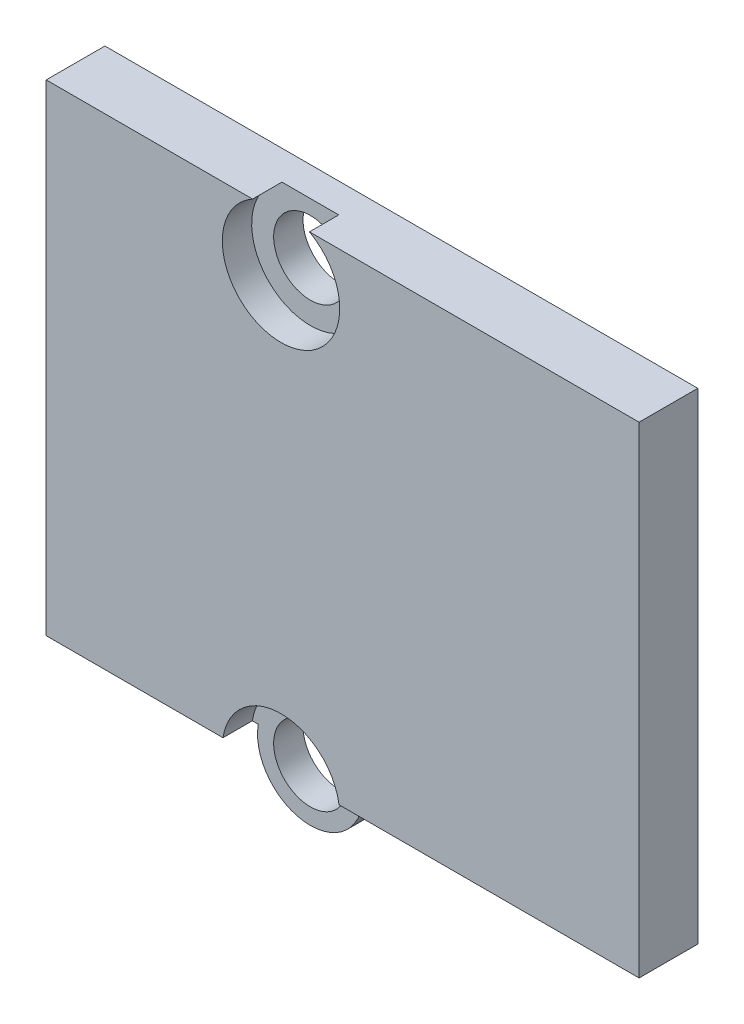
ISO-10303-21;
HEADER;
FILE_DESCRIPTION(('STEP AP214'),'2;1');
FILE_NAME('part.step','',(''),(''),'','','');
FILE_SCHEMA(('AUTOMOTIVE_DESIGN { 1 0 10303 214 1 1 1 1 }'));
ENDSEC;
DATA;
#1=APPLICATION_CONTEXT('core data for automotive mechanical design processes');
#2=APPLICATION_PROTOCOL_DEFINITION('international standard','automotive_design',2000,#1);
#3=PRODUCT_CONTEXT('',#1,'mechanical');
#4=PRODUCT('Part','Part','',(#3));
#5=PRODUCT_RELATED_PRODUCT_CATEGORY('part','',(#4));
#6=PRODUCT_DEFINITION_FORMATION('','',#4);
#7=PRODUCT_DEFINITION_CONTEXT('part definition',#1,'design');
#8=PRODUCT_DEFINITION('design','',#6,#7);
#9=PRODUCT_DEFINITION_SHAPE('','',#8);
#10=(LENGTH_UNIT() NAMED_UNIT(*) SI_UNIT(.MILLI.,.METRE.));
#11=(NAMED_UNIT(*) PLANE_ANGLE_UNIT() SI_UNIT($,.RADIAN.));
#12=(NAMED_UNIT(*) SI_UNIT($,.STERADIAN.) SOLID_ANGLE_UNIT());
#13=UNCERTAINTY_MEASURE_WITH_UNIT(LENGTH_MEASURE(1.E-05),#10,'distance_accuracy_value','');
#14=(GEOMETRIC_REPRESENTATION_CONTEXT(3) GLOBAL_UNCERTAINTY_ASSIGNED_CONTEXT((#13)) GLOBAL_UNIT_ASSIGNED_CONTEXT((#10,
#11,#12)) REPRESENTATION_CONTEXT('',''));
#15=CARTESIAN_POINT('',(0.,0.,0.));
#16=DIRECTION('',(0.,0.,1.));
#17=DIRECTION('',(1.,0.,0.));
#18=AXIS2_PLACEMENT_3D('',#15,#16,#17);
#19=CARTESIAN_POINT('',(0.,0.,2.));
#20=DIRECTION('',(0.,0.,-1.));
#21=DIRECTION('',(-1.,0.,0.));
#22=AXIS2_PLACEMENT_3D('',#19,#20,#21);
#23=CYLINDRICAL_SURFACE('',#22,1.8);
#24=CARTESIAN_POINT('',(0.,0.,1.));
#25=DIRECTION('',(0.,0.,1.));
#26=DIRECTION('',(1.,0.,0.));
#27=AXIS2_PLACEMENT_3D('',#24,#25,#26);
#28=CIRCLE('',#27,1.8);
#29=CARTESIAN_POINT('',(-1.77482393492989,0.299999999999998,1.));
#30=VERTEX_POINT('',#29);
#31=CARTESIAN_POINT('',(1.77482393492989,0.299999999999998,1.));
#32=VERTEX_POINT('',#31);
#33=EDGE_CURVE('E55',#30,#32,#28,.T.);
#34=ORIENTED_EDGE('',*,*,#33,.F.);
#35=DIRECTION('',(0.,0.,-1.));
#36=VECTOR('',#35,1.);
#37=CARTESIAN_POINT('',(-1.77482393492989,0.299999999999998,2.));
#38=LINE('',#37,#36);
#39=CARTESIAN_POINT('',(-1.77482393492989,0.299999999999998,0.));
#40=VERTEX_POINT('',#39);
#41=EDGE_CURVE('E161',#30,#40,#38,.T.);
#42=ORIENTED_EDGE('',*,*,#41,.T.);
#43=CARTESIAN_POINT('',(0.,0.,0.));
#44=DIRECTION('',(0.,0.,1.));
#45=DIRECTION('',(1.,0.,0.));
#46=AXIS2_PLACEMENT_3D('',#43,#44,#45);
#47=CIRCLE('',#46,1.8);
#48=CARTESIAN_POINT('',(1.77482393492989,0.299999999999998,0.));
#49=VERTEX_POINT('',#48);
#50=EDGE_CURVE('E152',#40,#49,#47,.T.);
#51=ORIENTED_EDGE('',*,*,#50,.T.);
#52=DIRECTION('',(0.,0.,-1.));
#53=VECTOR('',#52,1.);
#54=CARTESIAN_POINT('',(1.77482393492989,0.299999999999998,2.));
#55=LINE('',#54,#53);
#56=EDGE_CURVE('E159',#32,#49,#55,.T.);
#57=ORIENTED_EDGE('',*,*,#56,.F.);
#58=EDGE_LOOP('',(#34,#42,#51,#57));
#59=FACE_BOUND('',#58,.T.);
#60=ADVANCED_FACE('F33',(#59),#23,.T.);
#61=CARTESIAN_POINT('',(0.,0.,2.));
#62=DIRECTION('',(0.,0.,-1.));
#63=DIRECTION('',(-1.,0.,0.));
#64=AXIS2_PLACEMENT_3D('',#61,#62,#63);
#65=CYLINDRICAL_SURFACE('',#64,1.25);
#66=CARTESIAN_POINT('',(0.,0.,0.));
#67=DIRECTION('',(0.,0.,1.));
#68=DIRECTION('',(1.,0.,0.));
#69=AXIS2_PLACEMENT_3D('',#66,#67,#68);
#70=CIRCLE('',#69,1.25);
#71=CARTESIAN_POINT('',(1.25,0.,0.));
#72=VERTEX_POINT('',#71);
#73=EDGE_CURVE('E145',#72,#72,#70,.T.);
#74=ORIENTED_EDGE('',*,*,#73,.F.);
#75=EDGE_LOOP('',(#74));
#76=FACE_BOUND('',#75,.T.);
#77=CARTESIAN_POINT('',(0.,0.,1.));
#78=DIRECTION('',(0.,0.,1.));
#79=DIRECTION('',(1.,0.,0.));
#80=AXIS2_PLACEMENT_3D('',#77,#78,#79);
#81=CIRCLE('',#80,1.25);
#82=CARTESIAN_POINT('',(1.25,0.,1.));
#83=VERTEX_POINT('',#82);
#84=EDGE_CURVE('E175',#83,#83,#81,.T.);
#85=ORIENTED_EDGE('',*,*,#84,.T.);
#86=EDGE_LOOP('',(#85));
#87=FACE_BOUND('',#86,.T.);
#88=ADVANCED_FACE('F211',(#76,#87),#65,.F.);
#89=CARTESIAN_POINT('',(0.,14.95,2.));
#90=DIRECTION('',(0.,0.,-1.));
#91=DIRECTION('',(-1.,0.,0.));
#92=AXIS2_PLACEMENT_3D('',#89,#90,#91);
#93=CYLINDRICAL_SURFACE('',#92,1.25);
#94=CARTESIAN_POINT('',(0.,14.95,0.));
#95=DIRECTION('',(0.,0.,1.));
#96=DIRECTION('',(1.,0.,0.));
#97=AXIS2_PLACEMENT_3D('',#94,#95,#96);
#98=CIRCLE('',#97,1.25);
#99=CARTESIAN_POINT('',(1.25,14.95,0.));
#100=VERTEX_POINT('',#99);
#101=EDGE_CURVE('E199',#100,#100,#98,.T.);
#102=ORIENTED_EDGE('',*,*,#101,.F.);
#103=EDGE_LOOP('',(#102));
#104=FACE_BOUND('',#103,.T.);
#105=CARTESIAN_POINT('',(0.,14.95,1.));
#106=DIRECTION('',(0.,0.,1.));
#107=DIRECTION('',(1.,0.,0.));
#108=AXIS2_PLACEMENT_3D('',#105,#106,#107);
#109=CIRCLE('',#108,1.25);
#110=CARTESIAN_POINT('',(1.25,14.95,1.));
#111=VERTEX_POINT('',#110);
#112=EDGE_CURVE('E172',#111,#111,#109,.T.);
#113=ORIENTED_EDGE('',*,*,#112,.T.);
#114=EDGE_LOOP('',(#113));
#115=FACE_BOUND('',#114,.T.);
#116=ADVANCED_FACE('F214',(#104,#115),#93,.F.);
#117=CARTESIAN_POINT('',(0.,0.,2.));
#118=DIRECTION('',(0.,0.,1.));
#119=DIRECTION('',(1.,0.,0.));
#120=AXIS2_PLACEMENT_3D('',#117,#118,#119);
#121=PLANE('',#120);
#122=CARTESIAN_POINT('',(0.,14.95,2.));
#123=DIRECTION('',(0.,0.,1.));
#124=DIRECTION('',(1.,0.,0.));
#125=AXIS2_PLACEMENT_3D('',#122,#123,#124);
#126=CIRCLE('',#125,2.);
#127=CARTESIAN_POINT('',(-0.968245836551859,16.7,2.));
#128=VERTEX_POINT('',#127);
#129=CARTESIAN_POINT('',(0.968245836551858,16.7,2.));
#130=VERTEX_POINT('',#129);
#131=EDGE_CURVE('E109',#128,#130,#126,.T.);
#132=ORIENTED_EDGE('',*,*,#131,.F.);
#133=DIRECTION('',(-1.,0.,0.));
#134=VECTOR('',#133,1.);
#135=CARTESIAN_POINT('',(12.2,16.7,2.));
#136=LINE('',#135,#134);
#137=CARTESIAN_POINT('',(-8.,16.7,2.));
#138=VERTEX_POINT('',#137);
#139=EDGE_CURVE('E129',#128,#138,#136,.T.);
#140=ORIENTED_EDGE('',*,*,#139,.T.);
#141=DIRECTION('',(0.,-1.,0.));
#142=VECTOR('',#141,1.);
#143=CARTESIAN_POINT('',(-8.,16.7,2.));
#144=LINE('',#143,#142);
#145=CARTESIAN_POINT('',(-8.,0.299999999999998,2.));
#146=VERTEX_POINT('',#145);
#147=EDGE_CURVE('E128',#138,#146,#144,.T.);
#148=ORIENTED_EDGE('',*,*,#147,.T.);
#149=DIRECTION('',(1.,0.,0.));
#150=VECTOR('',#149,1.);
#151=CARTESIAN_POINT('',(-8.,0.299999999999998,2.));
#152=LINE('',#151,#150);
#153=CARTESIAN_POINT('',(-1.97737199332852,0.299999999999998,2.));
#154=VERTEX_POINT('',#153);
#155=EDGE_CURVE('E131',#146,#154,#152,.T.);
#156=ORIENTED_EDGE('',*,*,#155,.T.);
#157=CARTESIAN_POINT('',(0.,0.,2.));
#158=DIRECTION('',(0.,0.,1.));
#159=DIRECTION('',(1.,0.,0.));
#160=AXIS2_PLACEMENT_3D('',#157,#158,#159);
#161=CIRCLE('',#160,2.);
#162=CARTESIAN_POINT('',(1.97737199332852,0.299999999999998,2.));
#163=VERTEX_POINT('',#162);
#164=EDGE_CURVE('E349',#163,#154,#161,.T.);
#165=ORIENTED_EDGE('',*,*,#164,.F.);
#166=DIRECTION('',(1.,0.,0.));
#167=VECTOR('',#166,1.);
#168=CARTESIAN_POINT('',(1.77482393492989,0.299999999999998,2.));
#169=LINE('',#168,#167);
#170=CARTESIAN_POINT('',(12.2,0.299999999999998,2.));
#171=VERTEX_POINT('',#170);
#172=EDGE_CURVE('E138',#163,#171,#169,.T.);
#173=ORIENTED_EDGE('',*,*,#172,.T.);
#174=DIRECTION('',(0.,1.,0.));
#175=VECTOR('',#174,1.);
#176=CARTESIAN_POINT('',(12.2,0.299999999999998,2.));
#177=LINE('',#176,#175);
#178=CARTESIAN_POINT('',(12.2,16.7,2.));
#179=VERTEX_POINT('',#178);
#180=EDGE_CURVE('E126',#171,#179,#177,.T.);
#181=ORIENTED_EDGE('',*,*,#180,.T.);
#182=EDGE_CURVE('E121',#179,#130,#136,.T.);
#183=ORIENTED_EDGE('',*,*,#182,.T.);
#184=EDGE_LOOP('',(#132,#140,#148,#156,#165,#173,#181,#183));
#185=FACE_BOUND('',#184,.T.);
#186=ADVANCED_FACE('F124',(#185),#121,.T.);
#187=CARTESIAN_POINT('',(0.,0.,0.));
#188=DIRECTION('',(0.,0.,1.));
#189=DIRECTION('',(1.,0.,0.));
#190=AXIS2_PLACEMENT_3D('',#187,#188,#189);
#191=PLANE('',#190);
#192=DIRECTION('',(0.,1.,0.));
#193=VECTOR('',#192,1.);
#194=CARTESIAN_POINT('',(12.2,0.299999999999998,0.));
#195=LINE('',#194,#193);
#196=CARTESIAN_POINT('',(12.2,0.299999999999998,0.));
#197=VERTEX_POINT('',#196);
#198=CARTESIAN_POINT('',(12.2,16.7,0.));
#199=VERTEX_POINT('',#198);
#200=EDGE_CURVE('E141',#197,#199,#195,.T.);
#201=ORIENTED_EDGE('',*,*,#200,.F.);
#202=DIRECTION('',(1.,0.,0.));
#203=VECTOR('',#202,1.);
#204=CARTESIAN_POINT('',(1.77482393492989,0.299999999999998,0.));
#205=LINE('',#204,#203);
#206=EDGE_CURVE('E155',#49,#197,#205,.T.);
#207=ORIENTED_EDGE('',*,*,#206,.F.);
#208=ORIENTED_EDGE('',*,*,#50,.F.);
#209=DIRECTION('',(1.,0.,0.));
#210=VECTOR('',#209,1.);
#211=CARTESIAN_POINT('',(-8.,0.299999999999998,0.));
#212=LINE('',#211,#210);
#213=CARTESIAN_POINT('',(-8.,0.299999999999998,0.));
#214=VERTEX_POINT('',#213);
#215=EDGE_CURVE('E149',#214,#40,#212,.T.);
#216=ORIENTED_EDGE('',*,*,#215,.F.);
#217=DIRECTION('',(0.,-1.,0.));
#218=VECTOR('',#217,1.);
#219=CARTESIAN_POINT('',(-8.,16.7,0.));
#220=LINE('',#219,#218);
#221=CARTESIAN_POINT('',(-8.,16.7,0.));
#222=VERTEX_POINT('',#221);
#223=EDGE_CURVE('E147',#222,#214,#220,.T.);
#224=ORIENTED_EDGE('',*,*,#223,.F.);
#225=DIRECTION('',(-1.,0.,0.));
#226=VECTOR('',#225,1.);
#227=CARTESIAN_POINT('',(12.2,16.7,0.));
#228=LINE('',#227,#226);
#229=EDGE_CURVE('E144',#199,#222,#228,.T.);
#230=ORIENTED_EDGE('',*,*,#229,.F.);
#231=EDGE_LOOP('',(#201,#207,#208,#216,#224,#230));
#232=FACE_BOUND('',#231,.T.);
#233=ORIENTED_EDGE('',*,*,#73,.T.);
#234=EDGE_LOOP('',(#233));
#235=FACE_BOUND('',#234,.T.);
#236=ORIENTED_EDGE('',*,*,#101,.T.);
#237=EDGE_LOOP('',(#236));
#238=FACE_BOUND('',#237,.T.);
#239=ADVANCED_FACE('F208',(#232,#235,#238),#191,.F.);
#240=CARTESIAN_POINT('',(12.2,0.299999999999998,2.));
#241=DIRECTION('',(-1.,0.,0.));
#242=DIRECTION('',(0.,0.,1.));
#243=AXIS2_PLACEMENT_3D('',#240,#241,#242);
#244=PLANE('',#243);
#245=ORIENTED_EDGE('',*,*,#200,.T.);
#246=DIRECTION('',(0.,0.,-1.));
#247=VECTOR('',#246,1.);
#248=CARTESIAN_POINT('',(12.2,16.7,2.));
#249=LINE('',#248,#247);
#250=EDGE_CURVE('E169',#179,#199,#249,.T.);
#251=ORIENTED_EDGE('',*,*,#250,.F.);
#252=ORIENTED_EDGE('',*,*,#180,.F.);
#253=DIRECTION('',(0.,0.,-1.));
#254=VECTOR('',#253,1.);
#255=CARTESIAN_POINT('',(12.2,0.299999999999998,2.));
#256=LINE('',#255,#254);
#257=EDGE_CURVE('E140',#171,#197,#256,.T.);
#258=ORIENTED_EDGE('',*,*,#257,.T.);
#259=EDGE_LOOP('',(#245,#251,#252,#258));
#260=FACE_BOUND('',#259,.T.);
#261=ADVANCED_FACE('F35',(#260),#244,.F.);
#262=CARTESIAN_POINT('',(12.2,16.7,2.));
#263=DIRECTION('',(0.,-1.,0.));
#264=DIRECTION('',(1.,0.,0.));
#265=AXIS2_PLACEMENT_3D('',#262,#263,#264);
#266=PLANE('',#265);
#267=DIRECTION('',(-1.,0.,0.));
#268=VECTOR('',#267,1.);
#269=CARTESIAN_POINT('',(12.2,16.7,1.));
#270=LINE('',#269,#268);
#271=CARTESIAN_POINT('',(0.968245836551858,16.7,1.));
#272=VERTEX_POINT('',#271);
#273=CARTESIAN_POINT('',(-0.968245836551859,16.7,1.));
#274=VERTEX_POINT('',#273);
#275=EDGE_CURVE('E123',#272,#274,#270,.T.);
#276=ORIENTED_EDGE('',*,*,#275,.F.);
#277=DIRECTION('',(0.,0.,1.));
#278=VECTOR('',#277,1.);
#279=CARTESIAN_POINT('',(0.96824583655186,16.7,1.));
#280=LINE('',#279,#278);
#281=EDGE_CURVE('E11',#272,#130,#280,.T.);
#282=ORIENTED_EDGE('',*,*,#281,.T.);
#283=ORIENTED_EDGE('',*,*,#182,.F.);
#284=ORIENTED_EDGE('',*,*,#250,.T.);
#285=ORIENTED_EDGE('',*,*,#229,.T.);
#286=DIRECTION('',(0.,0.,-1.));
#287=VECTOR('',#286,1.);
#288=CARTESIAN_POINT('',(-8.,16.7,2.));
#289=LINE('',#288,#287);
#290=EDGE_CURVE('E166',#138,#222,#289,.T.);
#291=ORIENTED_EDGE('',*,*,#290,.F.);
#292=ORIENTED_EDGE('',*,*,#139,.F.);
#293=DIRECTION('',(0.,0.,1.));
#294=VECTOR('',#293,1.);
#295=CARTESIAN_POINT('',(-0.968245836551861,16.7,1.));
#296=LINE('',#295,#294);
#297=EDGE_CURVE('E41',#128,#274,#296,.F.);
#298=ORIENTED_EDGE('',*,*,#297,.T.);
#299=EDGE_LOOP('',(#276,#282,#283,#284,#285,#291,#292,#298));
#300=FACE_BOUND('',#299,.T.);
#301=ADVANCED_FACE('F119',(#300),#266,.F.);
#302=CARTESIAN_POINT('',(-8.,16.7,2.));
#303=DIRECTION('',(1.,0.,0.));
#304=DIRECTION('',(0.,0.,-1.));
#305=AXIS2_PLACEMENT_3D('',#302,#303,#304);
#306=PLANE('',#305);
#307=ORIENTED_EDGE('',*,*,#223,.T.);
#308=DIRECTION('',(0.,0.,-1.));
#309=VECTOR('',#308,1.);
#310=CARTESIAN_POINT('',(-8.,0.299999999999998,2.));
#311=LINE('',#310,#309);
#312=EDGE_CURVE('E163',#146,#214,#311,.T.);
#313=ORIENTED_EDGE('',*,*,#312,.F.);
#314=ORIENTED_EDGE('',*,*,#147,.F.);
#315=ORIENTED_EDGE('',*,*,#290,.T.);
#316=EDGE_LOOP('',(#307,#313,#314,#315));
#317=FACE_BOUND('',#316,.T.);
#318=ADVANCED_FACE('F186',(#317),#306,.F.);
#319=CARTESIAN_POINT('',(-8.,0.299999999999998,2.));
#320=DIRECTION('',(0.,1.,0.));
#321=DIRECTION('',(0.,0.,1.));
#322=AXIS2_PLACEMENT_3D('',#319,#320,#321);
#323=PLANE('',#322);
#324=DIRECTION('',(1.,0.,0.));
#325=VECTOR('',#324,1.);
#326=CARTESIAN_POINT('',(-8.,0.299999999999998,1.));
#327=LINE('',#326,#325);
#328=CARTESIAN_POINT('',(-1.97737199332852,0.299999999999998,1.));
#329=VERTEX_POINT('',#328);
#330=EDGE_CURVE('E195',#329,#30,#327,.T.);
#331=ORIENTED_EDGE('',*,*,#330,.F.);
#332=DIRECTION('',(0.,0.,1.));
#333=VECTOR('',#332,1.);
#334=CARTESIAN_POINT('',(-1.97737199332852,0.299999999999998,1.));
#335=LINE('',#334,#333);
#336=EDGE_CURVE('E193',#329,#154,#335,.T.);
#337=ORIENTED_EDGE('',*,*,#336,.T.);
#338=ORIENTED_EDGE('',*,*,#155,.F.);
#339=ORIENTED_EDGE('',*,*,#312,.T.);
#340=ORIENTED_EDGE('',*,*,#215,.T.);
#341=ORIENTED_EDGE('',*,*,#41,.F.);
#342=EDGE_LOOP('',(#331,#337,#338,#339,#340,#341));
#343=FACE_BOUND('',#342,.T.);
#344=ADVANCED_FACE('F192',(#343),#323,.F.);
#345=CARTESIAN_POINT('',(1.77482393492989,0.299999999999998,2.));
#346=DIRECTION('',(0.,1.,0.));
#347=DIRECTION('',(0.,0.,1.));
#348=AXIS2_PLACEMENT_3D('',#345,#346,#347);
#349=PLANE('',#348);
#350=ORIENTED_EDGE('',*,*,#172,.F.);
#351=DIRECTION('',(0.,0.,1.));
#352=VECTOR('',#351,1.);
#353=CARTESIAN_POINT('',(1.97737199332852,0.299999999999998,1.));
#354=LINE('',#353,#352);
#355=CARTESIAN_POINT('',(1.97737199332852,0.299999999999998,1.));
#356=VERTEX_POINT('',#355);
#357=EDGE_CURVE('E171',#163,#356,#354,.F.);
#358=ORIENTED_EDGE('',*,*,#357,.T.);
#359=DIRECTION('',(1.,0.,0.));
#360=VECTOR('',#359,1.);
#361=CARTESIAN_POINT('',(1.77482393492989,0.299999999999998,1.));
#362=LINE('',#361,#360);
#363=EDGE_CURVE('E178',#32,#356,#362,.T.);
#364=ORIENTED_EDGE('',*,*,#363,.F.);
#365=ORIENTED_EDGE('',*,*,#56,.T.);
#366=ORIENTED_EDGE('',*,*,#206,.T.);
#367=ORIENTED_EDGE('',*,*,#257,.F.);
#368=EDGE_LOOP('',(#350,#358,#364,#365,#366,#367));
#369=FACE_BOUND('',#368,.T.);
#370=ADVANCED_FACE('F231',(#369),#349,.F.);
#371=CARTESIAN_POINT('',(0.,14.95,1.));
#372=DIRECTION('',(0.,0.,1.));
#373=DIRECTION('',(1.,0.,0.));
#374=AXIS2_PLACEMENT_3D('',#371,#372,#373);
#375=CYLINDRICAL_SURFACE('',#374,2.);
#376=CARTESIAN_POINT('',(0.,14.95,1.));
#377=DIRECTION('',(0.,0.,1.));
#378=DIRECTION('',(1.,0.,0.));
#379=AXIS2_PLACEMENT_3D('',#376,#377,#378);
#380=CIRCLE('',#379,2.);
#381=EDGE_CURVE('E47',#274,#272,#380,.T.);
#382=ORIENTED_EDGE('',*,*,#381,.F.);
#383=ORIENTED_EDGE('',*,*,#297,.F.);
#384=ORIENTED_EDGE('',*,*,#131,.T.);
#385=ORIENTED_EDGE('',*,*,#281,.F.);
#386=EDGE_LOOP('',(#382,#383,#384,#385));
#387=FACE_BOUND('',#386,.T.);
#388=ADVANCED_FACE('F110',(#387),#375,.F.);
#389=CARTESIAN_POINT('',(0.,14.95,1.));
#390=DIRECTION('',(0.,0.,1.));
#391=DIRECTION('',(1.,0.,0.));
#392=AXIS2_PLACEMENT_3D('',#389,#390,#391);
#393=PLANE('',#392);
#394=ORIENTED_EDGE('',*,*,#112,.F.);
#395=EDGE_LOOP('',(#394));
#396=FACE_BOUND('',#395,.T.);
#397=ORIENTED_EDGE('',*,*,#275,.T.);
#398=ORIENTED_EDGE('',*,*,#381,.T.);
#399=EDGE_LOOP('',(#397,#398));
#400=FACE_BOUND('',#399,.T.);
#401=ADVANCED_FACE('F267',(#396,#400),#393,.T.);
#402=CARTESIAN_POINT('',(0.,0.,1.));
#403=DIRECTION('',(0.,0.,1.));
#404=DIRECTION('',(1.,0.,0.));
#405=AXIS2_PLACEMENT_3D('',#402,#403,#404);
#406=CYLINDRICAL_SURFACE('',#405,2.);
#407=CARTESIAN_POINT('',(0.,0.,1.));
#408=DIRECTION('',(0.,0.,1.));
#409=DIRECTION('',(1.,0.,0.));
#410=AXIS2_PLACEMENT_3D('',#407,#408,#409);
#411=CIRCLE('',#410,2.);
#412=EDGE_CURVE('E116',#356,#329,#411,.T.);
#413=ORIENTED_EDGE('',*,*,#412,.F.);
#414=ORIENTED_EDGE('',*,*,#357,.F.);
#415=ORIENTED_EDGE('',*,*,#164,.T.);
#416=ORIENTED_EDGE('',*,*,#336,.F.);
#417=EDGE_LOOP('',(#413,#414,#415,#416));
#418=FACE_BOUND('',#417,.T.);
#419=ADVANCED_FACE('F220',(#418),#406,.F.);
#420=CARTESIAN_POINT('',(0.,0.,1.));
#421=DIRECTION('',(0.,0.,1.));
#422=DIRECTION('',(1.,0.,0.));
#423=AXIS2_PLACEMENT_3D('',#420,#421,#422);
#424=PLANE('',#423);
#425=ORIENTED_EDGE('',*,*,#84,.F.);
#426=EDGE_LOOP('',(#425));
#427=FACE_BOUND('',#426,.T.);
#428=ORIENTED_EDGE('',*,*,#330,.T.);
#429=ORIENTED_EDGE('',*,*,#33,.T.);
#430=ORIENTED_EDGE('',*,*,#363,.T.);
#431=ORIENTED_EDGE('',*,*,#412,.T.);
#432=EDGE_LOOP('',(#428,#429,#430,#431));
#433=FACE_BOUND('',#432,.T.);
#434=ADVANCED_FACE('F218',(#427,#433),#424,.T.);
#435=CLOSED_SHELL('',(#60,#88,#116,#186,#239,#261,#301,#318,#344,#370,#388,#401,#419,#434));
#436=MANIFOLD_SOLID_BREP('B2',#435);
#437=ADVANCED_BREP_SHAPE_REPRESENTATION('',(#18,#436),#14);
#438=SHAPE_DEFINITION_REPRESENTATION(#9,#437);
ENDSEC;
END-ISO-10303-21;
